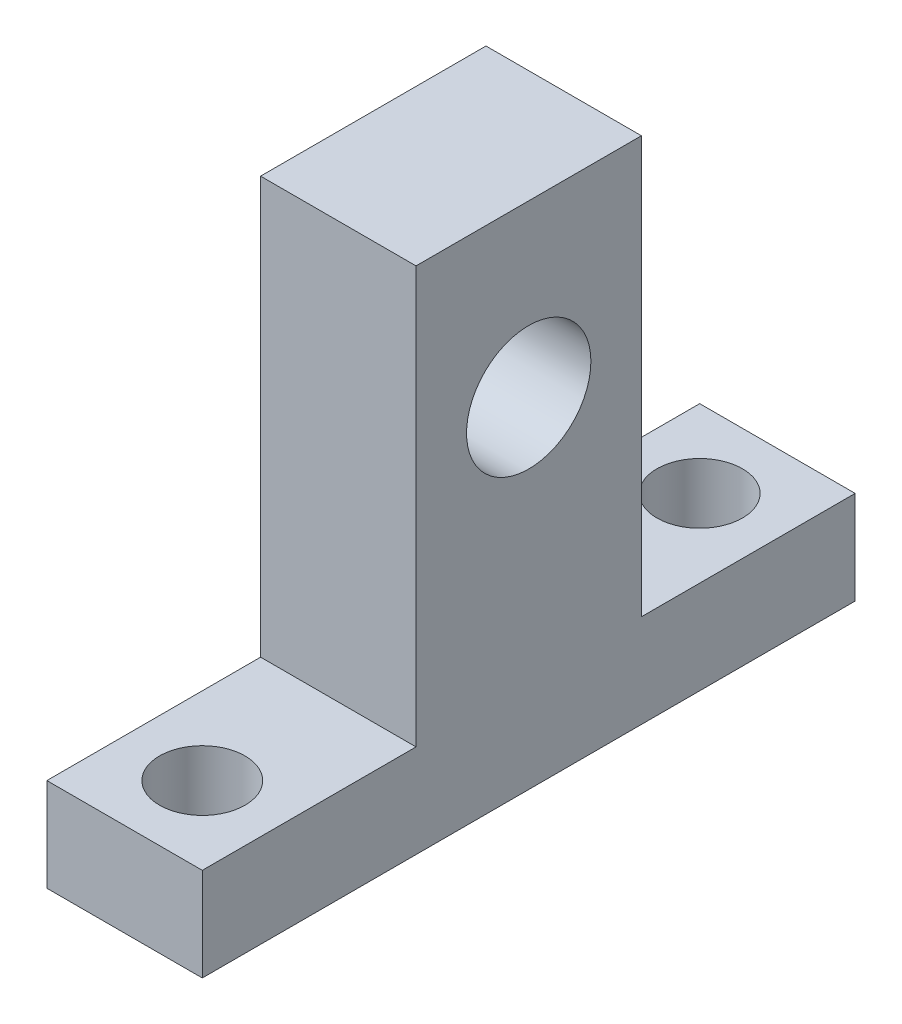
ISO-10303-21;
HEADER;
FILE_DESCRIPTION(('STEP AP214'),'2;1');
FILE_NAME('part.step','',(''),(''),'','','');
FILE_SCHEMA(('AUTOMOTIVE_DESIGN { 1 0 10303 214 1 1 1 1 }'));
ENDSEC;
DATA;
#1=APPLICATION_CONTEXT('core data for automotive mechanical design processes');
#2=APPLICATION_PROTOCOL_DEFINITION('international standard','automotive_design',2000,#1);
#3=PRODUCT_CONTEXT('',#1,'mechanical');
#4=PRODUCT('Part','Part','',(#3));
#5=PRODUCT_RELATED_PRODUCT_CATEGORY('part','',(#4));
#6=PRODUCT_DEFINITION_FORMATION('','',#4);
#7=PRODUCT_DEFINITION_CONTEXT('part definition',#1,'design');
#8=PRODUCT_DEFINITION('design','',#6,#7);
#9=PRODUCT_DEFINITION_SHAPE('','',#8);
#10=(LENGTH_UNIT() NAMED_UNIT(*) SI_UNIT(.MILLI.,.METRE.));
#11=(NAMED_UNIT(*) PLANE_ANGLE_UNIT() SI_UNIT($,.RADIAN.));
#12=(NAMED_UNIT(*) SI_UNIT($,.STERADIAN.) SOLID_ANGLE_UNIT());
#13=UNCERTAINTY_MEASURE_WITH_UNIT(LENGTH_MEASURE(1.E-05),#10,'distance_accuracy_value','');
#14=(GEOMETRIC_REPRESENTATION_CONTEXT(3) GLOBAL_UNCERTAINTY_ASSIGNED_CONTEXT((#13)) GLOBAL_UNIT_ASSIGNED_CONTEXT((#10,
#11,#12)) REPRESENTATION_CONTEXT('',''));
#15=CARTESIAN_POINT('',(0.,0.,0.));
#16=DIRECTION('',(0.,0.,1.));
#17=DIRECTION('',(1.,0.,0.));
#18=AXIS2_PLACEMENT_3D('',#15,#16,#17);
#19=CARTESIAN_POINT('',(-5.,6.,0.));
#20=DIRECTION('',(1.,0.,0.));
#21=DIRECTION('',(0.,0.,-1.));
#22=AXIS2_PLACEMENT_3D('',#19,#20,#21);
#23=PLANE('',#22);
#24=CARTESIAN_POINT('',(-5.,21.8549699522499,0.));
#25=DIRECTION('',(1.,0.,0.));
#26=DIRECTION('',(0.,0.,-1.));
#27=AXIS2_PLACEMENT_3D('',#24,#25,#26);
#28=CIRCLE('',#27,4.);
#29=CARTESIAN_POINT('',(-5.,21.8549699522499,-4.));
#30=VERTEX_POINT('',#29);
#31=EDGE_CURVE('E171',#30,#30,#28,.T.);
#32=ORIENTED_EDGE('',*,*,#31,.T.);
#33=EDGE_LOOP('',(#32));
#34=FACE_BOUND('',#33,.T.);
#35=DIRECTION('',(0.,0.,1.));
#36=VECTOR('',#35,1.);
#37=CARTESIAN_POINT('',(-5.,0.,0.));
#38=LINE('',#37,#36);
#39=CARTESIAN_POINT('',(-5.,0.,-21.));
#40=VERTEX_POINT('',#39);
#41=CARTESIAN_POINT('',(-5.,0.,21.));
#42=VERTEX_POINT('',#41);
#43=EDGE_CURVE('E125',#40,#42,#38,.T.);
#44=ORIENTED_EDGE('',*,*,#43,.T.);
#45=DIRECTION('',(0.,-1.,0.));
#46=VECTOR('',#45,1.);
#47=CARTESIAN_POINT('',(-5.,6.,21.));
#48=LINE('',#47,#46);
#49=CARTESIAN_POINT('',(-5.,6.,21.));
#50=VERTEX_POINT('',#49);
#51=EDGE_CURVE('E108',#50,#42,#48,.T.);
#52=ORIENTED_EDGE('',*,*,#51,.F.);
#53=DIRECTION('',(0.,0.,1.));
#54=VECTOR('',#53,1.);
#55=CARTESIAN_POINT('',(-5.,6.,0.));
#56=LINE('',#55,#54);
#57=CARTESIAN_POINT('',(-5.,6.,7.25));
#58=VERTEX_POINT('',#57);
#59=EDGE_CURVE('E103',#58,#50,#56,.T.);
#60=ORIENTED_EDGE('',*,*,#59,.F.);
#61=DIRECTION('',(0.,-1.,0.));
#62=VECTOR('',#61,1.);
#63=CARTESIAN_POINT('',(-5.,32.8,7.25));
#64=LINE('',#63,#62);
#65=CARTESIAN_POINT('',(-5.,32.8,7.25));
#66=VERTEX_POINT('',#65);
#67=EDGE_CURVE('E106',#66,#58,#64,.T.);
#68=ORIENTED_EDGE('',*,*,#67,.F.);
#69=DIRECTION('',(0.,0.,1.));
#70=VECTOR('',#69,1.);
#71=CARTESIAN_POINT('',(-5.,32.8,0.));
#72=LINE('',#71,#70);
#73=CARTESIAN_POINT('',(-5.,32.8,-7.25));
#74=VERTEX_POINT('',#73);
#75=EDGE_CURVE('E176',#74,#66,#72,.T.);
#76=ORIENTED_EDGE('',*,*,#75,.F.);
#77=DIRECTION('',(0.,-1.,0.));
#78=VECTOR('',#77,1.);
#79=CARTESIAN_POINT('',(-5.,32.8,-7.25));
#80=LINE('',#79,#78);
#81=CARTESIAN_POINT('',(-5.,6.,-7.25));
#82=VERTEX_POINT('',#81);
#83=EDGE_CURVE('E184',#74,#82,#80,.T.);
#84=ORIENTED_EDGE('',*,*,#83,.T.);
#85=DIRECTION('',(0.,0.,1.));
#86=VECTOR('',#85,1.);
#87=CARTESIAN_POINT('',(-5.,6.,0.));
#88=LINE('',#87,#86);
#89=CARTESIAN_POINT('',(-5.,6.,-21.));
#90=VERTEX_POINT('',#89);
#91=EDGE_CURVE('E133',#90,#82,#88,.T.);
#92=ORIENTED_EDGE('',*,*,#91,.F.);
#93=DIRECTION('',(0.,-1.,0.));
#94=VECTOR('',#93,1.);
#95=CARTESIAN_POINT('',(-5.,6.,-21.));
#96=LINE('',#95,#94);
#97=EDGE_CURVE('E40',#90,#40,#96,.T.);
#98=ORIENTED_EDGE('',*,*,#97,.T.);
#99=EDGE_LOOP('',(#44,#52,#60,#68,#76,#84,#92,#98));
#100=FACE_BOUND('',#99,.T.);
#101=ADVANCED_FACE('F32',(#34,#100),#23,.F.);
#102=CARTESIAN_POINT('',(5.,6.,0.));
#103=DIRECTION('',(1.,0.,0.));
#104=DIRECTION('',(0.,0.,-1.));
#105=AXIS2_PLACEMENT_3D('',#102,#103,#104);
#106=PLANE('',#105);
#107=CARTESIAN_POINT('',(5.,21.8549699522499,0.));
#108=DIRECTION('',(1.,0.,0.));
#109=DIRECTION('',(0.,0.,-1.));
#110=AXIS2_PLACEMENT_3D('',#107,#108,#109);
#111=CIRCLE('',#110,4.);
#112=CARTESIAN_POINT('',(5.,21.8549699522499,-4.));
#113=VERTEX_POINT('',#112);
#114=EDGE_CURVE('E315',#113,#113,#111,.T.);
#115=ORIENTED_EDGE('',*,*,#114,.F.);
#116=EDGE_LOOP('',(#115));
#117=FACE_BOUND('',#116,.T.);
#118=DIRECTION('',(0.,0.,1.));
#119=VECTOR('',#118,1.);
#120=CARTESIAN_POINT('',(5.,0.,0.));
#121=LINE('',#120,#119);
#122=CARTESIAN_POINT('',(5.,0.,-21.));
#123=VERTEX_POINT('',#122);
#124=CARTESIAN_POINT('',(5.,0.,21.));
#125=VERTEX_POINT('',#124);
#126=EDGE_CURVE('E145',#123,#125,#121,.T.);
#127=ORIENTED_EDGE('',*,*,#126,.F.);
#128=DIRECTION('',(0.,-1.,0.));
#129=VECTOR('',#128,1.);
#130=CARTESIAN_POINT('',(5.,6.,-21.));
#131=LINE('',#130,#129);
#132=CARTESIAN_POINT('',(5.,6.,-21.));
#133=VERTEX_POINT('',#132);
#134=EDGE_CURVE('E11',#133,#123,#131,.T.);
#135=ORIENTED_EDGE('',*,*,#134,.F.);
#136=DIRECTION('',(0.,0.,1.));
#137=VECTOR('',#136,1.);
#138=CARTESIAN_POINT('',(5.,6.,0.));
#139=LINE('',#138,#137);
#140=CARTESIAN_POINT('',(5.,6.,-7.25));
#141=VERTEX_POINT('',#140);
#142=EDGE_CURVE('E139',#133,#141,#139,.T.);
#143=ORIENTED_EDGE('',*,*,#142,.T.);
#144=DIRECTION('',(0.,-1.,0.));
#145=VECTOR('',#144,1.);
#146=CARTESIAN_POINT('',(5.,32.8,-7.25));
#147=LINE('',#146,#145);
#148=CARTESIAN_POINT('',(5.,32.8,-7.25));
#149=VERTEX_POINT('',#148);
#150=EDGE_CURVE('E73',#149,#141,#147,.T.);
#151=ORIENTED_EDGE('',*,*,#150,.F.);
#152=DIRECTION('',(0.,0.,1.));
#153=VECTOR('',#152,1.);
#154=CARTESIAN_POINT('',(5.,32.8,0.));
#155=LINE('',#154,#153);
#156=CARTESIAN_POINT('',(5.,32.8,7.25));
#157=VERTEX_POINT('',#156);
#158=EDGE_CURVE('E179',#149,#157,#155,.T.);
#159=ORIENTED_EDGE('',*,*,#158,.T.);
#160=DIRECTION('',(0.,-1.,0.));
#161=VECTOR('',#160,1.);
#162=CARTESIAN_POINT('',(5.,32.8,7.25));
#163=LINE('',#162,#161);
#164=CARTESIAN_POINT('',(5.,6.,7.25));
#165=VERTEX_POINT('',#164);
#166=EDGE_CURVE('E122',#157,#165,#163,.T.);
#167=ORIENTED_EDGE('',*,*,#166,.T.);
#168=DIRECTION('',(0.,0.,1.));
#169=VECTOR('',#168,1.);
#170=CARTESIAN_POINT('',(5.,6.,0.));
#171=LINE('',#170,#169);
#172=CARTESIAN_POINT('',(5.,6.,21.));
#173=VERTEX_POINT('',#172);
#174=EDGE_CURVE('E47',#165,#173,#171,.T.);
#175=ORIENTED_EDGE('',*,*,#174,.T.);
#176=DIRECTION('',(0.,-1.,0.));
#177=VECTOR('',#176,1.);
#178=CARTESIAN_POINT('',(5.,6.,21.));
#179=LINE('',#178,#177);
#180=EDGE_CURVE('E160',#173,#125,#179,.T.);
#181=ORIENTED_EDGE('',*,*,#180,.T.);
#182=EDGE_LOOP('',(#127,#135,#143,#151,#159,#167,#175,#181));
#183=FACE_BOUND('',#182,.T.);
#184=ADVANCED_FACE('F158',(#117,#183),#106,.T.);
#185=CARTESIAN_POINT('',(0.,6.,-16.));
#186=DIRECTION('',(0.,-1.,0.));
#187=DIRECTION('',(0.,0.,-1.));
#188=AXIS2_PLACEMENT_3D('',#185,#186,#187);
#189=CYLINDRICAL_SURFACE('',#188,2.75);
#190=CARTESIAN_POINT('',(0.,6.,-16.));
#191=DIRECTION('',(0.,1.,0.));
#192=DIRECTION('',(0.,0.,1.));
#193=AXIS2_PLACEMENT_3D('',#190,#191,#192);
#194=CIRCLE('',#193,2.75);
#195=CARTESIAN_POINT('',(0.,6.,-13.25));
#196=VERTEX_POINT('',#195);
#197=EDGE_CURVE('E130',#196,#196,#194,.T.);
#198=ORIENTED_EDGE('',*,*,#197,.T.);
#199=EDGE_LOOP('',(#198));
#200=FACE_BOUND('',#199,.T.);
#201=CARTESIAN_POINT('',(0.,0.,-16.));
#202=DIRECTION('',(0.,1.,0.));
#203=DIRECTION('',(0.,0.,1.));
#204=AXIS2_PLACEMENT_3D('',#201,#202,#203);
#205=CIRCLE('',#204,2.75);
#206=CARTESIAN_POINT('',(0.,0.,-13.25));
#207=VERTEX_POINT('',#206);
#208=EDGE_CURVE('E121',#207,#207,#205,.T.);
#209=ORIENTED_EDGE('',*,*,#208,.F.);
#210=EDGE_LOOP('',(#209));
#211=FACE_BOUND('',#210,.T.);
#212=ADVANCED_FACE('F34',(#200,#211),#189,.F.);
#213=CARTESIAN_POINT('',(0.,6.,-21.));
#214=DIRECTION('',(0.,0.,-1.));
#215=DIRECTION('',(-1.,0.,0.));
#216=AXIS2_PLACEMENT_3D('',#213,#214,#215);
#217=PLANE('',#216);
#218=DIRECTION('',(1.,0.,0.));
#219=VECTOR('',#218,1.);
#220=CARTESIAN_POINT('',(0.,0.,-21.));
#221=LINE('',#220,#219);
#222=EDGE_CURVE('E134',#40,#123,#221,.T.);
#223=ORIENTED_EDGE('',*,*,#222,.F.);
#224=ORIENTED_EDGE('',*,*,#97,.F.);
#225=DIRECTION('',(1.,0.,0.));
#226=VECTOR('',#225,1.);
#227=CARTESIAN_POINT('',(0.,6.,-21.));
#228=LINE('',#227,#226);
#229=EDGE_CURVE('E142',#90,#133,#228,.T.);
#230=ORIENTED_EDGE('',*,*,#229,.T.);
#231=ORIENTED_EDGE('',*,*,#134,.T.);
#232=EDGE_LOOP('',(#223,#224,#230,#231));
#233=FACE_BOUND('',#232,.T.);
#234=ADVANCED_FACE('F154',(#233),#217,.T.);
#235=CARTESIAN_POINT('',(0.,6.,0.));
#236=DIRECTION('',(0.,1.,0.));
#237=DIRECTION('',(0.,0.,1.));
#238=AXIS2_PLACEMENT_3D('',#235,#236,#237);
#239=PLANE('',#238);
#240=ORIENTED_EDGE('',*,*,#197,.F.);
#241=EDGE_LOOP('',(#240));
#242=FACE_BOUND('',#241,.T.);
#243=ORIENTED_EDGE('',*,*,#91,.T.);
#244=DIRECTION('',(1.,0.,0.));
#245=VECTOR('',#244,1.);
#246=CARTESIAN_POINT('',(0.,6.,-7.25));
#247=LINE('',#246,#245);
#248=EDGE_CURVE('E137',#82,#141,#247,.T.);
#249=ORIENTED_EDGE('',*,*,#248,.T.);
#250=ORIENTED_EDGE('',*,*,#142,.F.);
#251=ORIENTED_EDGE('',*,*,#229,.F.);
#252=EDGE_LOOP('',(#243,#249,#250,#251));
#253=FACE_BOUND('',#252,.T.);
#254=ADVANCED_FACE('F188',(#242,#253),#239,.T.);
#255=CARTESIAN_POINT('',(0.,0.,0.));
#256=DIRECTION('',(0.,1.,0.));
#257=DIRECTION('',(0.,0.,1.));
#258=AXIS2_PLACEMENT_3D('',#255,#256,#257);
#259=PLANE('',#258);
#260=ORIENTED_EDGE('',*,*,#208,.T.);
#261=EDGE_LOOP('',(#260));
#262=FACE_BOUND('',#261,.T.);
#263=ORIENTED_EDGE('',*,*,#43,.F.);
#264=ORIENTED_EDGE('',*,*,#222,.T.);
#265=ORIENTED_EDGE('',*,*,#126,.T.);
#266=DIRECTION('',(1.,0.,0.));
#267=VECTOR('',#266,1.);
#268=CARTESIAN_POINT('',(0.,0.,21.));
#269=LINE('',#268,#267);
#270=EDGE_CURVE('E164',#42,#125,#269,.T.);
#271=ORIENTED_EDGE('',*,*,#270,.F.);
#272=EDGE_LOOP('',(#263,#264,#265,#271));
#273=FACE_BOUND('',#272,.T.);
#274=CARTESIAN_POINT('',(0.,0.,16.));
#275=DIRECTION('',(0.,1.,0.));
#276=DIRECTION('',(0.,0.,1.));
#277=AXIS2_PLACEMENT_3D('',#274,#275,#276);
#278=CIRCLE('',#277,2.75);
#279=CARTESIAN_POINT('',(0.,0.,18.75));
#280=VERTEX_POINT('',#279);
#281=EDGE_CURVE('E166',#280,#280,#278,.T.);
#282=ORIENTED_EDGE('',*,*,#281,.T.);
#283=EDGE_LOOP('',(#282));
#284=FACE_BOUND('',#283,.T.);
#285=ADVANCED_FACE('F149',(#262,#273,#284),#259,.F.);
#286=CARTESIAN_POINT('',(0.,32.8,-7.25));
#287=DIRECTION('',(0.,0.,-1.));
#288=DIRECTION('',(-1.,0.,0.));
#289=AXIS2_PLACEMENT_3D('',#286,#287,#288);
#290=PLANE('',#289);
#291=ORIENTED_EDGE('',*,*,#248,.F.);
#292=ORIENTED_EDGE('',*,*,#83,.F.);
#293=DIRECTION('',(1.,0.,0.));
#294=VECTOR('',#293,1.);
#295=CARTESIAN_POINT('',(0.,32.8,-7.25));
#296=LINE('',#295,#294);
#297=EDGE_CURVE('E182',#74,#149,#296,.T.);
#298=ORIENTED_EDGE('',*,*,#297,.T.);
#299=ORIENTED_EDGE('',*,*,#150,.T.);
#300=EDGE_LOOP('',(#291,#292,#298,#299));
#301=FACE_BOUND('',#300,.T.);
#302=ADVANCED_FACE('F192',(#301),#290,.T.);
#303=CARTESIAN_POINT('',(0.,32.8,7.25));
#304=DIRECTION('',(0.,0.,-1.));
#305=DIRECTION('',(-1.,0.,0.));
#306=AXIS2_PLACEMENT_3D('',#303,#304,#305);
#307=PLANE('',#306);
#308=ORIENTED_EDGE('',*,*,#67,.T.);
#309=DIRECTION('',(1.,0.,0.));
#310=VECTOR('',#309,1.);
#311=CARTESIAN_POINT('',(0.,6.,7.25));
#312=LINE('',#311,#310);
#313=EDGE_CURVE('E110',#58,#165,#312,.T.);
#314=ORIENTED_EDGE('',*,*,#313,.T.);
#315=ORIENTED_EDGE('',*,*,#166,.F.);
#316=DIRECTION('',(1.,0.,0.));
#317=VECTOR('',#316,1.);
#318=CARTESIAN_POINT('',(0.,32.8,7.25));
#319=LINE('',#318,#317);
#320=EDGE_CURVE('E119',#66,#157,#319,.T.);
#321=ORIENTED_EDGE('',*,*,#320,.F.);
#322=EDGE_LOOP('',(#308,#314,#315,#321));
#323=FACE_BOUND('',#322,.T.);
#324=ADVANCED_FACE('F118',(#323),#307,.F.);
#325=CARTESIAN_POINT('',(0.,32.8,0.));
#326=DIRECTION('',(0.,1.,0.));
#327=DIRECTION('',(0.,0.,1.));
#328=AXIS2_PLACEMENT_3D('',#325,#326,#327);
#329=PLANE('',#328);
#330=ORIENTED_EDGE('',*,*,#75,.T.);
#331=ORIENTED_EDGE('',*,*,#320,.T.);
#332=ORIENTED_EDGE('',*,*,#158,.F.);
#333=ORIENTED_EDGE('',*,*,#297,.F.);
#334=EDGE_LOOP('',(#330,#331,#332,#333));
#335=FACE_BOUND('',#334,.T.);
#336=ADVANCED_FACE('F191',(#335),#329,.T.);
#337=CARTESIAN_POINT('',(0.,6.,21.));
#338=DIRECTION('',(0.,0.,-1.));
#339=DIRECTION('',(-1.,0.,0.));
#340=AXIS2_PLACEMENT_3D('',#337,#338,#339);
#341=PLANE('',#340);
#342=ORIENTED_EDGE('',*,*,#270,.T.);
#343=ORIENTED_EDGE('',*,*,#180,.F.);
#344=DIRECTION('',(1.,0.,0.));
#345=VECTOR('',#344,1.);
#346=CARTESIAN_POINT('',(0.,6.,21.));
#347=LINE('',#346,#345);
#348=EDGE_CURVE('E109',#50,#173,#347,.T.);
#349=ORIENTED_EDGE('',*,*,#348,.F.);
#350=ORIENTED_EDGE('',*,*,#51,.T.);
#351=EDGE_LOOP('',(#342,#343,#349,#350));
#352=FACE_BOUND('',#351,.T.);
#353=ADVANCED_FACE('F165',(#352),#341,.F.);
#354=CARTESIAN_POINT('',(0.,6.,16.));
#355=DIRECTION('',(0.,-1.,0.));
#356=DIRECTION('',(0.,0.,-1.));
#357=AXIS2_PLACEMENT_3D('',#354,#355,#356);
#358=CYLINDRICAL_SURFACE('',#357,2.75);
#359=CARTESIAN_POINT('',(0.,6.,16.));
#360=DIRECTION('',(0.,1.,0.));
#361=DIRECTION('',(0.,0.,1.));
#362=AXIS2_PLACEMENT_3D('',#359,#360,#361);
#363=CIRCLE('',#362,2.75);
#364=CARTESIAN_POINT('',(0.,6.,18.75));
#365=VERTEX_POINT('',#364);
#366=EDGE_CURVE('E116',#365,#365,#363,.T.);
#367=ORIENTED_EDGE('',*,*,#366,.T.);
#368=EDGE_LOOP('',(#367));
#369=FACE_BOUND('',#368,.T.);
#370=ORIENTED_EDGE('',*,*,#281,.F.);
#371=EDGE_LOOP('',(#370));
#372=FACE_BOUND('',#371,.T.);
#373=ADVANCED_FACE('F271',(#369,#372),#358,.F.);
#374=CARTESIAN_POINT('',(0.,6.,0.));
#375=DIRECTION('',(0.,1.,0.));
#376=DIRECTION('',(0.,0.,1.));
#377=AXIS2_PLACEMENT_3D('',#374,#375,#376);
#378=PLANE('',#377);
#379=ORIENTED_EDGE('',*,*,#366,.F.);
#380=EDGE_LOOP('',(#379));
#381=FACE_BOUND('',#380,.T.);
#382=ORIENTED_EDGE('',*,*,#313,.F.);
#383=ORIENTED_EDGE('',*,*,#59,.T.);
#384=ORIENTED_EDGE('',*,*,#348,.T.);
#385=ORIENTED_EDGE('',*,*,#174,.F.);
#386=EDGE_LOOP('',(#382,#383,#384,#385));
#387=FACE_BOUND('',#386,.T.);
#388=ADVANCED_FACE('F112',(#381,#387),#378,.T.);
#389=CARTESIAN_POINT('',(-27.8,21.8549699522499,0.));
#390=DIRECTION('',(1.,0.,0.));
#391=DIRECTION('',(0.,0.,-1.));
#392=AXIS2_PLACEMENT_3D('',#389,#390,#391);
#393=CYLINDRICAL_SURFACE('',#392,4.);
#394=ORIENTED_EDGE('',*,*,#114,.T.);
#395=EDGE_LOOP('',(#394));
#396=FACE_BOUND('',#395,.T.);
#397=ORIENTED_EDGE('',*,*,#31,.F.);
#398=EDGE_LOOP('',(#397));
#399=FACE_BOUND('',#398,.T.);
#400=ADVANCED_FACE('F288',(#396,#399),#393,.F.);
#401=CLOSED_SHELL('',(#101,#184,#212,#234,#254,#285,#302,#324,#336,#353,#373,#388,#400));
#402=MANIFOLD_SOLID_BREP('B2',#401);
#403=ADVANCED_BREP_SHAPE_REPRESENTATION('',(#18,#402),#14);
#404=SHAPE_DEFINITION_REPRESENTATION(#9,#403);
ENDSEC;
END-ISO-10303-21;
